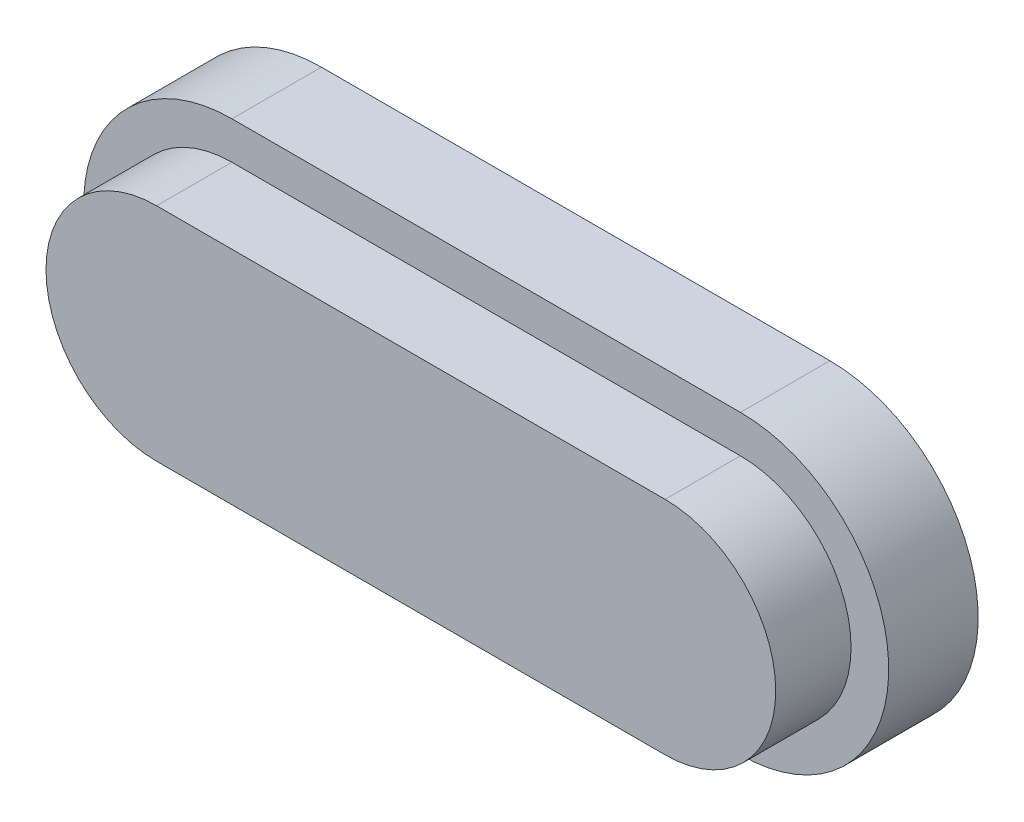
ISO-10303-21;
HEADER;
FILE_DESCRIPTION(('STEP AP214'),'2;1');
FILE_NAME('part.step','',(''),(''),'','','');
FILE_SCHEMA(('AUTOMOTIVE_DESIGN { 1 0 10303 214 1 1 1 1 }'));
ENDSEC;
DATA;
#1=APPLICATION_CONTEXT('core data for automotive mechanical design processes');
#2=APPLICATION_PROTOCOL_DEFINITION('international standard','automotive_design',2000,#1);
#3=PRODUCT_CONTEXT('',#1,'mechanical');
#4=PRODUCT('Part','Part','',(#3));
#5=PRODUCT_RELATED_PRODUCT_CATEGORY('part','',(#4));
#6=PRODUCT_DEFINITION_FORMATION('','',#4);
#7=PRODUCT_DEFINITION_CONTEXT('part definition',#1,'design');
#8=PRODUCT_DEFINITION('design','',#6,#7);
#9=PRODUCT_DEFINITION_SHAPE('','',#8);
#10=(LENGTH_UNIT() NAMED_UNIT(*) SI_UNIT(.MILLI.,.METRE.));
#11=(NAMED_UNIT(*) PLANE_ANGLE_UNIT() SI_UNIT($,.RADIAN.));
#12=(NAMED_UNIT(*) SI_UNIT($,.STERADIAN.) SOLID_ANGLE_UNIT());
#13=UNCERTAINTY_MEASURE_WITH_UNIT(LENGTH_MEASURE(1.E-05),#10,'distance_accuracy_value','');
#14=(GEOMETRIC_REPRESENTATION_CONTEXT(3) GLOBAL_UNCERTAINTY_ASSIGNED_CONTEXT((#13)) GLOBAL_UNIT_ASSIGNED_CONTEXT((#10,
#11,#12)) REPRESENTATION_CONTEXT('',''));
#15=CARTESIAN_POINT('',(0.,0.,0.));
#16=DIRECTION('',(0.,0.,1.));
#17=DIRECTION('',(1.,0.,0.));
#18=AXIS2_PLACEMENT_3D('',#15,#16,#17);
#19=CARTESIAN_POINT('',(0.,-3.15,3.5));
#20=DIRECTION('',(0.,0.,-1.));
#21=DIRECTION('',(-1.,0.,0.));
#22=AXIS2_PLACEMENT_3D('',#19,#20,#21);
#23=CYLINDRICAL_SURFACE('',#22,2.35);
#24=CARTESIAN_POINT('',(0.,-3.15,1.9));
#25=DIRECTION('',(0.,0.,1.));
#26=DIRECTION('',(1.,0.,0.));
#27=AXIS2_PLACEMENT_3D('',#24,#25,#26);
#28=CIRCLE('',#27,2.35);
#29=CARTESIAN_POINT('',(0.,-0.799999999999999,1.9));
#30=VERTEX_POINT('',#29);
#31=CARTESIAN_POINT('',(0.,-5.5,1.9));
#32=VERTEX_POINT('',#31);
#33=EDGE_CURVE('E154',#30,#32,#28,.T.);
#34=ORIENTED_EDGE('',*,*,#33,.T.);
#35=DIRECTION('',(0.,0.,-1.));
#36=VECTOR('',#35,1.);
#37=CARTESIAN_POINT('',(0.,-5.5,3.5));
#38=LINE('',#37,#36);
#39=CARTESIAN_POINT('',(0.,-5.5,3.5));
#40=VERTEX_POINT('',#39);
#41=EDGE_CURVE('E13',#40,#32,#38,.T.);
#42=ORIENTED_EDGE('',*,*,#41,.F.);
#43=CARTESIAN_POINT('',(0.,-3.15,3.5));
#44=DIRECTION('',(0.,0.,1.));
#45=DIRECTION('',(1.,0.,0.));
#46=AXIS2_PLACEMENT_3D('',#43,#44,#45);
#47=CIRCLE('',#46,2.35);
#48=CARTESIAN_POINT('',(0.,-0.799999999999999,3.5));
#49=VERTEX_POINT('',#48);
#50=EDGE_CURVE('E142',#49,#40,#47,.T.);
#51=ORIENTED_EDGE('',*,*,#50,.F.);
#52=DIRECTION('',(0.,0.,-1.));
#53=VECTOR('',#52,1.);
#54=CARTESIAN_POINT('',(0.,-0.799999999999999,3.5));
#55=LINE('',#54,#53);
#56=EDGE_CURVE('E150',#49,#30,#55,.T.);
#57=ORIENTED_EDGE('',*,*,#56,.T.);
#58=EDGE_LOOP('',(#34,#42,#51,#57));
#59=FACE_BOUND('',#58,.T.);
#60=ADVANCED_FACE('F91',(#59),#23,.T.);
#61=CARTESIAN_POINT('',(0.,-5.5,3.5));
#62=DIRECTION('',(0.,1.,0.));
#63=DIRECTION('',(0.,0.,1.));
#64=AXIS2_PLACEMENT_3D('',#61,#62,#63);
#65=PLANE('',#64);
#66=DIRECTION('',(1.,0.,0.));
#67=VECTOR('',#66,1.);
#68=CARTESIAN_POINT('',(0.,-5.5,1.9));
#69=LINE('',#68,#67);
#70=CARTESIAN_POINT('',(10.8,-5.5,1.9));
#71=VERTEX_POINT('',#70);
#72=EDGE_CURVE('E146',#32,#71,#69,.T.);
#73=ORIENTED_EDGE('',*,*,#72,.T.);
#74=DIRECTION('',(0.,0.,-1.));
#75=VECTOR('',#74,1.);
#76=CARTESIAN_POINT('',(10.8,-5.5,3.5));
#77=LINE('',#76,#75);
#78=CARTESIAN_POINT('',(10.8,-5.5,3.5));
#79=VERTEX_POINT('',#78);
#80=EDGE_CURVE('E99',#79,#71,#77,.T.);
#81=ORIENTED_EDGE('',*,*,#80,.F.);
#82=DIRECTION('',(1.,0.,0.));
#83=VECTOR('',#82,1.);
#84=CARTESIAN_POINT('',(0.,-5.5,3.5));
#85=LINE('',#84,#83);
#86=EDGE_CURVE('E137',#40,#79,#85,.T.);
#87=ORIENTED_EDGE('',*,*,#86,.F.);
#88=ORIENTED_EDGE('',*,*,#41,.T.);
#89=EDGE_LOOP('',(#73,#81,#87,#88));
#90=FACE_BOUND('',#89,.T.);
#91=ADVANCED_FACE('F145',(#90),#65,.F.);
#92=CARTESIAN_POINT('',(10.8,-3.15,3.5));
#93=DIRECTION('',(0.,0.,-1.));
#94=DIRECTION('',(-1.,0.,0.));
#95=AXIS2_PLACEMENT_3D('',#92,#93,#94);
#96=CYLINDRICAL_SURFACE('',#95,2.35);
#97=CARTESIAN_POINT('',(10.8,-3.15,1.9));
#98=DIRECTION('',(0.,0.,1.));
#99=DIRECTION('',(1.,0.,0.));
#100=AXIS2_PLACEMENT_3D('',#97,#98,#99);
#101=CIRCLE('',#100,2.35);
#102=CARTESIAN_POINT('',(10.8,-0.799999999999999,1.9));
#103=VERTEX_POINT('',#102);
#104=EDGE_CURVE('E124',#71,#103,#101,.T.);
#105=ORIENTED_EDGE('',*,*,#104,.T.);
#106=DIRECTION('',(0.,0.,-1.));
#107=VECTOR('',#106,1.);
#108=CARTESIAN_POINT('',(10.8,-0.799999999999999,3.5));
#109=LINE('',#108,#107);
#110=CARTESIAN_POINT('',(10.8,-0.799999999999999,3.5));
#111=VERTEX_POINT('',#110);
#112=EDGE_CURVE('E147',#111,#103,#109,.T.);
#113=ORIENTED_EDGE('',*,*,#112,.F.);
#114=CARTESIAN_POINT('',(10.8,-3.15,3.5));
#115=DIRECTION('',(0.,0.,1.));
#116=DIRECTION('',(1.,0.,0.));
#117=AXIS2_PLACEMENT_3D('',#114,#115,#116);
#118=CIRCLE('',#117,2.35);
#119=EDGE_CURVE('E140',#79,#111,#118,.T.);
#120=ORIENTED_EDGE('',*,*,#119,.F.);
#121=ORIENTED_EDGE('',*,*,#80,.T.);
#122=EDGE_LOOP('',(#105,#113,#120,#121));
#123=FACE_BOUND('',#122,.T.);
#124=ADVANCED_FACE('F148',(#123),#96,.T.);
#125=CARTESIAN_POINT('',(0.,-0.799999999999999,3.5));
#126=DIRECTION('',(0.,-1.,0.));
#127=DIRECTION('',(0.,0.,-1.));
#128=AXIS2_PLACEMENT_3D('',#125,#126,#127);
#129=PLANE('',#128);
#130=DIRECTION('',(-1.,0.,0.));
#131=VECTOR('',#130,1.);
#132=CARTESIAN_POINT('',(0.,-0.799999999999999,1.9));
#133=LINE('',#132,#131);
#134=EDGE_CURVE('E130',#103,#30,#133,.T.);
#135=ORIENTED_EDGE('',*,*,#134,.T.);
#136=ORIENTED_EDGE('',*,*,#56,.F.);
#137=DIRECTION('',(-1.,0.,0.));
#138=VECTOR('',#137,1.);
#139=CARTESIAN_POINT('',(0.,-0.799999999999999,3.5));
#140=LINE('',#139,#138);
#141=EDGE_CURVE('E107',#111,#49,#140,.T.);
#142=ORIENTED_EDGE('',*,*,#141,.F.);
#143=ORIENTED_EDGE('',*,*,#112,.T.);
#144=EDGE_LOOP('',(#135,#136,#142,#143));
#145=FACE_BOUND('',#144,.T.);
#146=ADVANCED_FACE('F161',(#145),#129,.F.);
#147=CARTESIAN_POINT('',(0.,-0.799999999999999,3.5));
#148=DIRECTION('',(0.,0.,1.));
#149=DIRECTION('',(1.,0.,0.));
#150=AXIS2_PLACEMENT_3D('',#147,#148,#149);
#151=PLANE('',#150);
#152=ORIENTED_EDGE('',*,*,#50,.T.);
#153=ORIENTED_EDGE('',*,*,#86,.T.);
#154=ORIENTED_EDGE('',*,*,#119,.T.);
#155=ORIENTED_EDGE('',*,*,#141,.T.);
#156=EDGE_LOOP('',(#152,#153,#154,#155));
#157=FACE_BOUND('',#156,.T.);
#158=ADVANCED_FACE('F138',(#157),#151,.T.);
#159=CARTESIAN_POINT('',(0.,-0.799999999999999,1.9));
#160=DIRECTION('',(0.,0.,1.));
#161=DIRECTION('',(1.,0.,0.));
#162=AXIS2_PLACEMENT_3D('',#159,#160,#161);
#163=PLANE('',#162);
#164=ORIENTED_EDGE('',*,*,#33,.F.);
#165=ORIENTED_EDGE('',*,*,#134,.F.);
#166=ORIENTED_EDGE('',*,*,#104,.F.);
#167=ORIENTED_EDGE('',*,*,#72,.F.);
#168=EDGE_LOOP('',(#164,#165,#166,#167));
#169=FACE_BOUND('',#168,.T.);
#170=ADVANCED_FACE('F164',(#169),#163,.F.);
#171=CLOSED_SHELL('',(#60,#91,#124,#146,#158,#170));
#172=MANIFOLD_SOLID_BREP('B2',#171);
#173=CARTESIAN_POINT('',(0.,-3.15,1.9));
#174=DIRECTION('',(0.,0.,-1.));
#175=DIRECTION('',(-1.,0.,0.));
#176=AXIS2_PLACEMENT_3D('',#173,#174,#175);
#177=CYLINDRICAL_SURFACE('',#176,3.15);
#178=CARTESIAN_POINT('',(0.,-3.15,0.));
#179=DIRECTION('',(0.,0.,1.));
#180=DIRECTION('',(1.,0.,0.));
#181=AXIS2_PLACEMENT_3D('',#178,#179,#180);
#182=CIRCLE('',#181,3.15);
#183=CARTESIAN_POINT('',(0.,0.,0.));
#184=VERTEX_POINT('',#183);
#185=CARTESIAN_POINT('',(0.,-6.3,0.));
#186=VERTEX_POINT('',#185);
#187=EDGE_CURVE('E301',#184,#186,#182,.T.);
#188=ORIENTED_EDGE('',*,*,#187,.T.);
#189=DIRECTION('',(0.,0.,-1.));
#190=VECTOR('',#189,1.);
#191=CARTESIAN_POINT('',(0.,-6.3,1.9));
#192=LINE('',#191,#190);
#193=CARTESIAN_POINT('',(0.,-6.3,1.9));
#194=VERTEX_POINT('',#193);
#195=EDGE_CURVE('E260',#194,#186,#192,.T.);
#196=ORIENTED_EDGE('',*,*,#195,.F.);
#197=CARTESIAN_POINT('',(0.,-3.15,1.9));
#198=DIRECTION('',(0.,0.,1.));
#199=DIRECTION('',(1.,0.,0.));
#200=AXIS2_PLACEMENT_3D('',#197,#198,#199);
#201=CIRCLE('',#200,3.15);
#202=CARTESIAN_POINT('',(0.,0.,1.9));
#203=VERTEX_POINT('',#202);
#204=EDGE_CURVE('E365',#203,#194,#201,.T.);
#205=ORIENTED_EDGE('',*,*,#204,.F.);
#206=DIRECTION('',(0.,0.,-1.));
#207=VECTOR('',#206,1.);
#208=CARTESIAN_POINT('',(0.,0.,1.9));
#209=LINE('',#208,#207);
#210=EDGE_CURVE('E326',#203,#184,#209,.T.);
#211=ORIENTED_EDGE('',*,*,#210,.T.);
#212=EDGE_LOOP('',(#188,#196,#205,#211));
#213=FACE_BOUND('',#212,.T.);
#214=ADVANCED_FACE('F242',(#213),#177,.T.);
#215=CARTESIAN_POINT('',(0.,0.,0.));
#216=DIRECTION('',(0.,0.,1.));
#217=DIRECTION('',(1.,0.,0.));
#218=AXIS2_PLACEMENT_3D('',#215,#216,#217);
#219=PLANE('',#218);
#220=CARTESIAN_POINT('',(7.7,-3.15,0.));
#221=DIRECTION('',(0.,0.,1.));
#222=DIRECTION('',(1.,0.,0.));
#223=AXIS2_PLACEMENT_3D('',#220,#221,#222);
#224=CIRCLE('',#223,0.9);
#225=CARTESIAN_POINT('',(8.6,-3.15,0.));
#226=VERTEX_POINT('',#225);
#227=EDGE_CURVE('E89',#226,#226,#224,.F.);
#228=ORIENTED_EDGE('',*,*,#227,.F.);
#229=EDGE_LOOP('',(#228));
#230=FACE_BOUND('',#229,.T.);
#231=CARTESIAN_POINT('',(3.1,-3.15,0.));
#232=DIRECTION('',(0.,0.,1.));
#233=DIRECTION('',(1.,0.,0.));
#234=AXIS2_PLACEMENT_3D('',#231,#232,#233);
#235=CIRCLE('',#234,0.9);
#236=CARTESIAN_POINT('',(4.,-3.15,0.));
#237=VERTEX_POINT('',#236);
#238=EDGE_CURVE('E252',#237,#237,#235,.F.);
#239=ORIENTED_EDGE('',*,*,#238,.F.);
#240=EDGE_LOOP('',(#239));
#241=FACE_BOUND('',#240,.T.);
#242=CARTESIAN_POINT('',(5.4,-3.15,0.));
#243=DIRECTION('',(0.,0.,1.));
#244=DIRECTION('',(1.,0.,0.));
#245=AXIS2_PLACEMENT_3D('',#242,#243,#244);
#246=CIRCLE('',#245,0.9);
#247=CARTESIAN_POINT('',(6.3,-3.15,0.));
#248=VERTEX_POINT('',#247);
#249=EDGE_CURVE('E323',#248,#248,#246,.F.);
#250=ORIENTED_EDGE('',*,*,#249,.F.);
#251=EDGE_LOOP('',(#250));
#252=FACE_BOUND('',#251,.T.);
#253=ORIENTED_EDGE('',*,*,#187,.F.);
#254=DIRECTION('',(1.,0.,0.));
#255=VECTOR('',#254,1.);
#256=CARTESIAN_POINT('',(0.,0.,0.));
#257=LINE('',#256,#255);
#258=CARTESIAN_POINT('',(10.8,0.,0.));
#259=VERTEX_POINT('',#258);
#260=EDGE_CURVE('E288',#184,#259,#257,.T.);
#261=ORIENTED_EDGE('',*,*,#260,.T.);
#262=CARTESIAN_POINT('',(10.8,-3.15,0.));
#263=DIRECTION('',(0.,0.,1.));
#264=DIRECTION('',(1.,0.,0.));
#265=AXIS2_PLACEMENT_3D('',#262,#263,#264);
#266=CIRCLE('',#265,3.15);
#267=CARTESIAN_POINT('',(10.8,-6.3,0.));
#268=VERTEX_POINT('',#267);
#269=EDGE_CURVE('E300',#268,#259,#266,.T.);
#270=ORIENTED_EDGE('',*,*,#269,.F.);
#271=DIRECTION('',(1.,0.,0.));
#272=VECTOR('',#271,1.);
#273=CARTESIAN_POINT('',(0.,-6.3,0.));
#274=LINE('',#273,#272);
#275=EDGE_CURVE('E303',#186,#268,#274,.T.);
#276=ORIENTED_EDGE('',*,*,#275,.F.);
#277=EDGE_LOOP('',(#253,#261,#270,#276));
#278=FACE_BOUND('',#277,.T.);
#279=ADVANCED_FACE('F298',(#230,#241,#252,#278),#219,.F.);
#280=CARTESIAN_POINT('',(0.,0.,1.9));
#281=DIRECTION('',(0.,0.,1.));
#282=DIRECTION('',(1.,0.,0.));
#283=AXIS2_PLACEMENT_3D('',#280,#281,#282);
#284=PLANE('',#283);
#285=ORIENTED_EDGE('',*,*,#204,.T.);
#286=DIRECTION('',(1.,0.,0.));
#287=VECTOR('',#286,1.);
#288=CARTESIAN_POINT('',(0.,-6.3,1.9));
#289=LINE('',#288,#287);
#290=CARTESIAN_POINT('',(10.8,-6.3,1.9));
#291=VERTEX_POINT('',#290);
#292=EDGE_CURVE('E308',#194,#291,#289,.T.);
#293=ORIENTED_EDGE('',*,*,#292,.T.);
#294=CARTESIAN_POINT('',(10.8,-3.15,1.9));
#295=DIRECTION('',(0.,0.,1.));
#296=DIRECTION('',(1.,0.,0.));
#297=AXIS2_PLACEMENT_3D('',#294,#295,#296);
#298=CIRCLE('',#297,3.15);
#299=CARTESIAN_POINT('',(10.8,0.,1.9));
#300=VERTEX_POINT('',#299);
#301=EDGE_CURVE('E294',#291,#300,#298,.T.);
#302=ORIENTED_EDGE('',*,*,#301,.T.);
#303=DIRECTION('',(1.,0.,0.));
#304=VECTOR('',#303,1.);
#305=CARTESIAN_POINT('',(0.,0.,1.9));
#306=LINE('',#305,#304);
#307=EDGE_CURVE('E291',#203,#300,#306,.T.);
#308=ORIENTED_EDGE('',*,*,#307,.F.);
#309=EDGE_LOOP('',(#285,#293,#302,#308));
#310=FACE_BOUND('',#309,.T.);
#311=ADVANCED_FACE('F335',(#310),#284,.T.);
#312=CARTESIAN_POINT('',(10.8,-3.15,1.9));
#313=DIRECTION('',(0.,0.,-1.));
#314=DIRECTION('',(-1.,0.,0.));
#315=AXIS2_PLACEMENT_3D('',#312,#313,#314);
#316=CYLINDRICAL_SURFACE('',#315,3.15);
#317=ORIENTED_EDGE('',*,*,#269,.T.);
#318=DIRECTION('',(0.,0.,-1.));
#319=VECTOR('',#318,1.);
#320=CARTESIAN_POINT('',(10.8,0.,1.9));
#321=LINE('',#320,#319);
#322=EDGE_CURVE('E286',#300,#259,#321,.T.);
#323=ORIENTED_EDGE('',*,*,#322,.F.);
#324=ORIENTED_EDGE('',*,*,#301,.F.);
#325=DIRECTION('',(0.,0.,-1.));
#326=VECTOR('',#325,1.);
#327=CARTESIAN_POINT('',(10.8,-6.3,1.9));
#328=LINE('',#327,#326);
#329=EDGE_CURVE('E280',#291,#268,#328,.T.);
#330=ORIENTED_EDGE('',*,*,#329,.T.);
#331=EDGE_LOOP('',(#317,#323,#324,#330));
#332=FACE_BOUND('',#331,.T.);
#333=ADVANCED_FACE('F306',(#332),#316,.T.);
#334=CARTESIAN_POINT('',(0.,-6.3,1.9));
#335=DIRECTION('',(0.,1.,0.));
#336=DIRECTION('',(0.,0.,1.));
#337=AXIS2_PLACEMENT_3D('',#334,#335,#336);
#338=PLANE('',#337);
#339=ORIENTED_EDGE('',*,*,#275,.T.);
#340=ORIENTED_EDGE('',*,*,#329,.F.);
#341=ORIENTED_EDGE('',*,*,#292,.F.);
#342=ORIENTED_EDGE('',*,*,#195,.T.);
#343=EDGE_LOOP('',(#339,#340,#341,#342));
#344=FACE_BOUND('',#343,.T.);
#345=ADVANCED_FACE('F351',(#344),#338,.F.);
#346=CARTESIAN_POINT('',(0.,0.,1.9));
#347=DIRECTION('',(0.,1.,0.));
#348=DIRECTION('',(0.,0.,1.));
#349=AXIS2_PLACEMENT_3D('',#346,#347,#348);
#350=PLANE('',#349);
#351=ORIENTED_EDGE('',*,*,#260,.F.);
#352=ORIENTED_EDGE('',*,*,#210,.F.);
#353=ORIENTED_EDGE('',*,*,#307,.T.);
#354=ORIENTED_EDGE('',*,*,#322,.T.);
#355=EDGE_LOOP('',(#351,#352,#353,#354));
#356=FACE_BOUND('',#355,.T.);
#357=ADVANCED_FACE('F244',(#356),#350,.T.);
#358=CARTESIAN_POINT('',(5.4,-3.15,-1.1));
#359=DIRECTION('',(0.,0.,1.));
#360=DIRECTION('',(1.,0.,0.));
#361=AXIS2_PLACEMENT_3D('',#358,#359,#360);
#362=CYLINDRICAL_SURFACE('',#361,0.9);
#363=CARTESIAN_POINT('',(5.4,-3.15,-1.1));
#364=DIRECTION('',(0.,0.,-1.));
#365=DIRECTION('',(-1.,0.,0.));
#366=AXIS2_PLACEMENT_3D('',#363,#364,#365);
#367=CIRCLE('',#366,0.9);
#368=CARTESIAN_POINT('',(4.5,-3.15,-1.1));
#369=VERTEX_POINT('',#368);
#370=EDGE_CURVE('E304',#369,#369,#367,.T.);
#371=ORIENTED_EDGE('',*,*,#370,.F.);
#372=EDGE_LOOP('',(#371));
#373=FACE_BOUND('',#372,.T.);
#374=ORIENTED_EDGE('',*,*,#249,.T.);
#375=EDGE_LOOP('',(#374));
#376=FACE_BOUND('',#375,.T.);
#377=ADVANCED_FACE('F340',(#373,#376),#362,.T.);
#378=CARTESIAN_POINT('',(5.4,-3.15,-1.1));
#379=DIRECTION('',(0.,0.,-1.));
#380=DIRECTION('',(-1.,0.,0.));
#381=AXIS2_PLACEMENT_3D('',#378,#379,#380);
#382=PLANE('',#381);
#383=ORIENTED_EDGE('',*,*,#370,.T.);
#384=EDGE_LOOP('',(#383));
#385=FACE_BOUND('',#384,.T.);
#386=ADVANCED_FACE('F342',(#385),#382,.T.);
#387=CARTESIAN_POINT('',(3.1,-3.15,-1.1));
#388=DIRECTION('',(0.,0.,1.));
#389=DIRECTION('',(1.,0.,0.));
#390=AXIS2_PLACEMENT_3D('',#387,#388,#389);
#391=CYLINDRICAL_SURFACE('',#390,0.9);
#392=CARTESIAN_POINT('',(3.1,-3.15,-1.1));
#393=DIRECTION('',(0.,0.,-1.));
#394=DIRECTION('',(-1.,0.,0.));
#395=AXIS2_PLACEMENT_3D('',#392,#393,#394);
#396=CIRCLE('',#395,0.9);
#397=CARTESIAN_POINT('',(2.2,-3.15,-1.1));
#398=VERTEX_POINT('',#397);
#399=EDGE_CURVE('E377',#398,#398,#396,.T.);
#400=ORIENTED_EDGE('',*,*,#399,.F.);
#401=EDGE_LOOP('',(#400));
#402=FACE_BOUND('',#401,.T.);
#403=ORIENTED_EDGE('',*,*,#238,.T.);
#404=EDGE_LOOP('',(#403));
#405=FACE_BOUND('',#404,.T.);
#406=ADVANCED_FACE('F331',(#402,#405),#391,.T.);
#407=CARTESIAN_POINT('',(3.1,-3.15,-1.1));
#408=DIRECTION('',(0.,0.,-1.));
#409=DIRECTION('',(-1.,0.,0.));
#410=AXIS2_PLACEMENT_3D('',#407,#408,#409);
#411=PLANE('',#410);
#412=ORIENTED_EDGE('',*,*,#399,.T.);
#413=EDGE_LOOP('',(#412));
#414=FACE_BOUND('',#413,.T.);
#415=ADVANCED_FACE('F391',(#414),#411,.T.);
#416=CARTESIAN_POINT('',(7.7,-3.15,-1.1));
#417=DIRECTION('',(0.,0.,1.));
#418=DIRECTION('',(1.,0.,0.));
#419=AXIS2_PLACEMENT_3D('',#416,#417,#418);
#420=CYLINDRICAL_SURFACE('',#419,0.9);
#421=CARTESIAN_POINT('',(7.7,-3.15,-1.1));
#422=DIRECTION('',(0.,0.,-1.));
#423=DIRECTION('',(-1.,0.,0.));
#424=AXIS2_PLACEMENT_3D('',#421,#422,#423);
#425=CIRCLE('',#424,0.9);
#426=CARTESIAN_POINT('',(6.8,-3.15,-1.1));
#427=VERTEX_POINT('',#426);
#428=EDGE_CURVE('E381',#427,#427,#425,.T.);
#429=ORIENTED_EDGE('',*,*,#428,.F.);
#430=EDGE_LOOP('',(#429));
#431=FACE_BOUND('',#430,.T.);
#432=ORIENTED_EDGE('',*,*,#227,.T.);
#433=EDGE_LOOP('',(#432));
#434=FACE_BOUND('',#433,.T.);
#435=ADVANCED_FACE('F388',(#431,#434),#420,.T.);
#436=CARTESIAN_POINT('',(7.7,-3.15,-1.1));
#437=DIRECTION('',(0.,0.,-1.));
#438=DIRECTION('',(-1.,0.,0.));
#439=AXIS2_PLACEMENT_3D('',#436,#437,#438);
#440=PLANE('',#439);
#441=ORIENTED_EDGE('',*,*,#428,.T.);
#442=EDGE_LOOP('',(#441));
#443=FACE_BOUND('',#442,.T.);
#444=ADVANCED_FACE('F386',(#443),#440,.T.);
#445=CLOSED_SHELL('',(#214,#279,#311,#333,#345,#357,#377,#386,#406,#415,#435,#444));
#446=MANIFOLD_SOLID_BREP('B7',#445);
#447=ADVANCED_BREP_SHAPE_REPRESENTATION('',(#18,#172,#446),#14);
#448=SHAPE_DEFINITION_REPRESENTATION(#9,#447);
ENDSEC;
END-ISO-10303-21;
